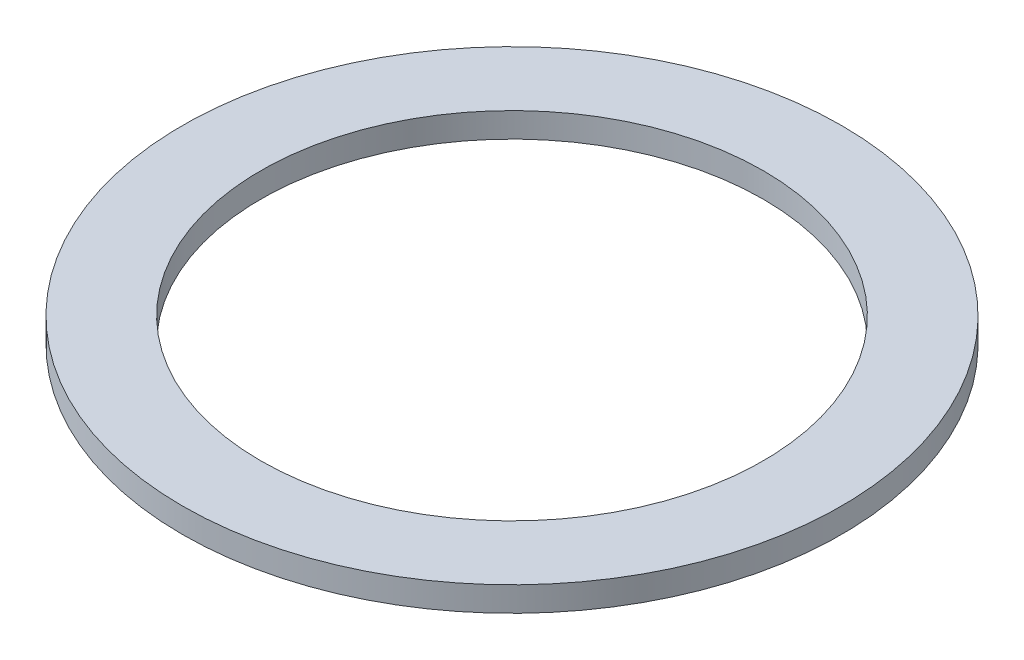
ISO-10303-21;
HEADER;
FILE_DESCRIPTION(('STEP AP214'),'2;1');
FILE_NAME('part.step','',(''),(''),'','','');
FILE_SCHEMA(('AUTOMOTIVE_DESIGN { 1 0 10303 214 1 1 1 1 }'));
ENDSEC;
DATA;
#1=APPLICATION_CONTEXT('core data for automotive mechanical design processes');
#2=APPLICATION_PROTOCOL_DEFINITION('international standard','automotive_design',2000,#1);
#3=PRODUCT_CONTEXT('',#1,'mechanical');
#4=PRODUCT('Part','Part','',(#3));
#5=PRODUCT_RELATED_PRODUCT_CATEGORY('part','',(#4));
#6=PRODUCT_DEFINITION_FORMATION('','',#4);
#7=PRODUCT_DEFINITION_CONTEXT('part definition',#1,'design');
#8=PRODUCT_DEFINITION('design','',#6,#7);
#9=PRODUCT_DEFINITION_SHAPE('','',#8);
#10=(LENGTH_UNIT() NAMED_UNIT(*) SI_UNIT(.MILLI.,.METRE.));
#11=(NAMED_UNIT(*) PLANE_ANGLE_UNIT() SI_UNIT($,.RADIAN.));
#12=(NAMED_UNIT(*) SI_UNIT($,.STERADIAN.) SOLID_ANGLE_UNIT());
#13=UNCERTAINTY_MEASURE_WITH_UNIT(LENGTH_MEASURE(1.E-05),#10,'distance_accuracy_value','');
#14=(GEOMETRIC_REPRESENTATION_CONTEXT(3) GLOBAL_UNCERTAINTY_ASSIGNED_CONTEXT((#13)) GLOBAL_UNIT_ASSIGNED_CONTEXT((#10,
#11,#12)) REPRESENTATION_CONTEXT('',''));
#15=CARTESIAN_POINT('',(0.,0.,0.));
#16=DIRECTION('',(0.,0.,1.));
#17=DIRECTION('',(1.,0.,0.));
#18=AXIS2_PLACEMENT_3D('',#15,#16,#17);
#19=CARTESIAN_POINT('',(0.,3.,0.));
#20=DIRECTION('',(0.,1.,0.));
#21=DIRECTION('',(0.,0.,1.00000000000001));
#22=AXIS2_PLACEMENT_3D('',#19,#20,#21);
#23=PLANE('',#22);
#24=CARTESIAN_POINT('',(0.,3.,0.));
#25=DIRECTION('',(0.,1.,0.));
#26=DIRECTION('',(0.,0.,1.00000000000001));
#27=AXIS2_PLACEMENT_3D('',#24,#25,#26);
#28=CIRCLE('',#27,30.5);
#29=CARTESIAN_POINT('',(0.,3.,30.5000000000003));
#30=VERTEX_POINT('',#29);
#31=EDGE_CURVE('E26',#30,#30,#28,.F.);
#32=ORIENTED_EDGE('',*,*,#31,.T.);
#33=EDGE_LOOP('',(#32));
#34=FACE_BOUND('',#33,.T.);
#35=CARTESIAN_POINT('',(0.,3.,0.));
#36=DIRECTION('',(0.,1.,0.));
#37=DIRECTION('',(0.,0.,1.00000000000001));
#38=AXIS2_PLACEMENT_3D('',#35,#36,#37);
#39=CIRCLE('',#38,40.);
#40=CARTESIAN_POINT('',(0.,3.,40.0000000000004));
#41=VERTEX_POINT('',#40);
#42=EDGE_CURVE('E17',#41,#41,#39,.F.);
#43=ORIENTED_EDGE('',*,*,#42,.F.);
#44=EDGE_LOOP('',(#43));
#45=FACE_BOUND('',#44,.T.);
#46=ADVANCED_FACE('F14',(#34,#45),#23,.T.);
#47=CARTESIAN_POINT('',(0.,0.,0.));
#48=DIRECTION('',(0.,1.,0.));
#49=DIRECTION('',(0.,0.,1.00000000000001));
#50=AXIS2_PLACEMENT_3D('',#47,#48,#49);
#51=CYLINDRICAL_SURFACE('',#50,40.);
#52=ORIENTED_EDGE('',*,*,#42,.T.);
#53=EDGE_LOOP('',(#52));
#54=FACE_BOUND('',#53,.T.);
#55=CARTESIAN_POINT('',(0.,0.,0.));
#56=DIRECTION('',(0.,1.,0.));
#57=DIRECTION('',(0.,0.,1.00000000000001));
#58=AXIS2_PLACEMENT_3D('',#55,#56,#57);
#59=CIRCLE('',#58,40.);
#60=CARTESIAN_POINT('',(0.,0.,40.0000000000004));
#61=VERTEX_POINT('',#60);
#62=EDGE_CURVE('E21',#61,#61,#59,.T.);
#63=ORIENTED_EDGE('',*,*,#62,.T.);
#64=EDGE_LOOP('',(#63));
#65=FACE_BOUND('',#64,.T.);
#66=ADVANCED_FACE('F34',(#54,#65),#51,.T.);
#67=CARTESIAN_POINT('',(0.,0.,0.));
#68=DIRECTION('',(0.,1.,0.));
#69=DIRECTION('',(0.,0.,1.00000000000001));
#70=AXIS2_PLACEMENT_3D('',#67,#68,#69);
#71=CYLINDRICAL_SURFACE('',#70,30.5);
#72=ORIENTED_EDGE('',*,*,#31,.F.);
#73=EDGE_LOOP('',(#72));
#74=FACE_BOUND('',#73,.T.);
#75=CARTESIAN_POINT('',(0.,0.,0.));
#76=DIRECTION('',(0.,1.,0.));
#77=DIRECTION('',(0.,0.,1.00000000000001));
#78=AXIS2_PLACEMENT_3D('',#75,#76,#77);
#79=CIRCLE('',#78,30.5);
#80=CARTESIAN_POINT('',(0.,0.,30.5000000000003));
#81=VERTEX_POINT('',#80);
#82=EDGE_CURVE('E10',#81,#81,#79,.F.);
#83=ORIENTED_EDGE('',*,*,#82,.T.);
#84=EDGE_LOOP('',(#83));
#85=FACE_BOUND('',#84,.T.);
#86=ADVANCED_FACE('F42',(#74,#85),#71,.F.);
#87=CARTESIAN_POINT('',(0.,0.,0.));
#88=DIRECTION('',(0.,1.,0.));
#89=DIRECTION('',(0.,0.,1.00000000000001));
#90=AXIS2_PLACEMENT_3D('',#87,#88,#89);
#91=PLANE('',#90);
#92=ORIENTED_EDGE('',*,*,#82,.F.);
#93=EDGE_LOOP('',(#92));
#94=FACE_BOUND('',#93,.T.);
#95=ORIENTED_EDGE('',*,*,#62,.F.);
#96=EDGE_LOOP('',(#95));
#97=FACE_BOUND('',#96,.T.);
#98=ADVANCED_FACE('F43',(#94,#97),#91,.F.);
#99=CLOSED_SHELL('',(#46,#66,#86,#98));
#100=MANIFOLD_SOLID_BREP('B1',#99);
#101=ADVANCED_BREP_SHAPE_REPRESENTATION('',(#18,#100),#14);
#102=SHAPE_DEFINITION_REPRESENTATION(#9,#101);
ENDSEC;
END-ISO-10303-21;
